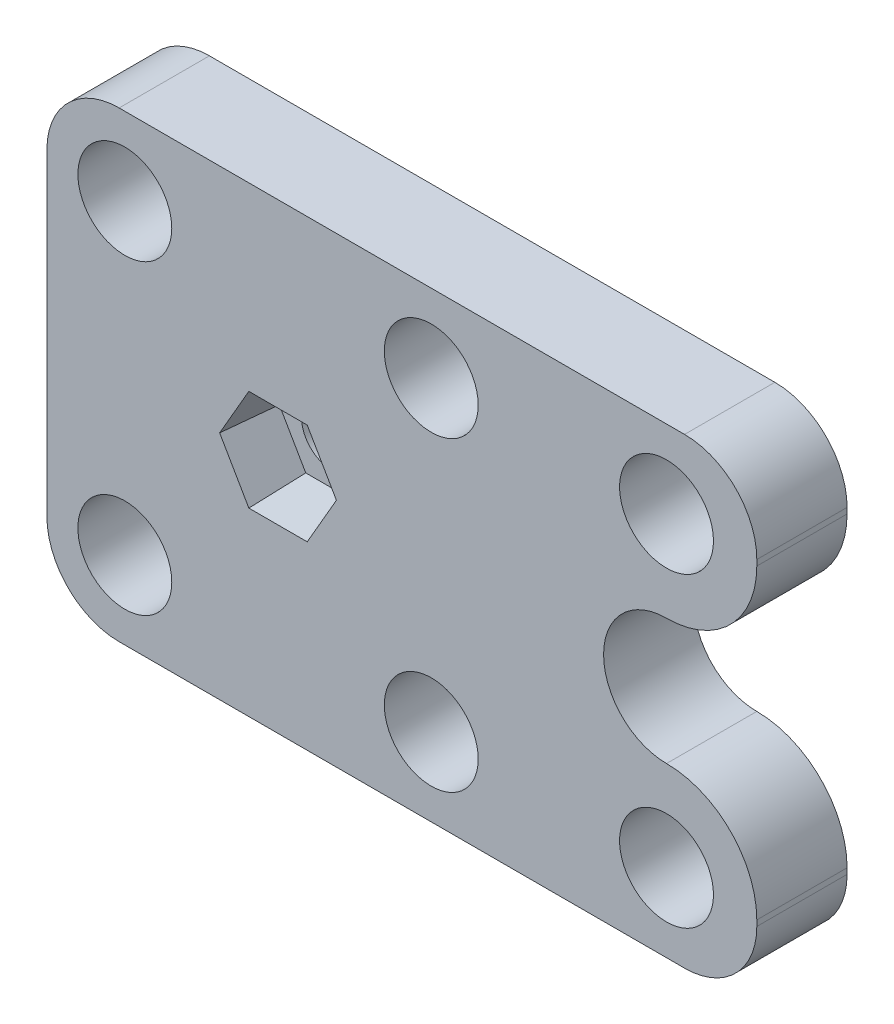
ISO-10303-21;
HEADER;
FILE_DESCRIPTION(('STEP AP214'),'2;1');
FILE_NAME('part.step','',(''),(''),'','','');
FILE_SCHEMA(('AUTOMOTIVE_DESIGN { 1 0 10303 214 1 1 1 1 }'));
ENDSEC;
DATA;
#1=APPLICATION_CONTEXT('core data for automotive mechanical design processes');
#2=APPLICATION_PROTOCOL_DEFINITION('international standard','automotive_design',2000,#1);
#3=PRODUCT_CONTEXT('',#1,'mechanical');
#4=PRODUCT('Part','Part','',(#3));
#5=PRODUCT_RELATED_PRODUCT_CATEGORY('part','',(#4));
#6=PRODUCT_DEFINITION_FORMATION('','',#4);
#7=PRODUCT_DEFINITION_CONTEXT('part definition',#1,'design');
#8=PRODUCT_DEFINITION('design','',#6,#7);
#9=PRODUCT_DEFINITION_SHAPE('','',#8);
#10=(LENGTH_UNIT() NAMED_UNIT(*) SI_UNIT(.MILLI.,.METRE.));
#11=(NAMED_UNIT(*) PLANE_ANGLE_UNIT() SI_UNIT($,.RADIAN.));
#12=(NAMED_UNIT(*) SI_UNIT($,.STERADIAN.) SOLID_ANGLE_UNIT());
#13=UNCERTAINTY_MEASURE_WITH_UNIT(LENGTH_MEASURE(1.E-05),#10,'distance_accuracy_value','');
#14=(GEOMETRIC_REPRESENTATION_CONTEXT(3) GLOBAL_UNCERTAINTY_ASSIGNED_CONTEXT((#13)) GLOBAL_UNIT_ASSIGNED_CONTEXT((#10,
#11,#12)) REPRESENTATION_CONTEXT('',''));
#15=CARTESIAN_POINT('',(0.,0.,0.));
#16=DIRECTION('',(0.,0.,1.));
#17=DIRECTION('',(1.,0.,0.));
#18=AXIS2_PLACEMENT_3D('',#15,#16,#17);
#19=CARTESIAN_POINT('',(0.,0.,5.));
#20=DIRECTION('',(0.,0.,-1.));
#21=DIRECTION('',(-1.,0.,0.));
#22=AXIS2_PLACEMENT_3D('',#19,#20,#21);
#23=CYLINDRICAL_SURFACE('',#22,1.7);
#24=CARTESIAN_POINT('',(0.,0.,0.));
#25=DIRECTION('',(0.,0.,1.));
#26=DIRECTION('',(1.,0.,0.));
#27=AXIS2_PLACEMENT_3D('',#24,#25,#26);
#28=CIRCLE('',#27,1.7);
#29=CARTESIAN_POINT('',(1.7,0.,0.));
#30=VERTEX_POINT('',#29);
#31=EDGE_CURVE('E255',#30,#30,#28,.T.);
#32=ORIENTED_EDGE('',*,*,#31,.F.);
#33=EDGE_LOOP('',(#32));
#34=FACE_BOUND('',#33,.T.);
#35=CARTESIAN_POINT('',(0.,0.,2.));
#36=DIRECTION('',(0.,0.,1.));
#37=DIRECTION('',(1.,0.,0.));
#38=AXIS2_PLACEMENT_3D('',#35,#36,#37);
#39=CIRCLE('',#38,1.7);
#40=CARTESIAN_POINT('',(1.7,0.,2.));
#41=VERTEX_POINT('',#40);
#42=EDGE_CURVE('E200',#41,#41,#39,.T.);
#43=ORIENTED_EDGE('',*,*,#42,.T.);
#44=EDGE_LOOP('',(#43));
#45=FACE_BOUND('',#44,.T.);
#46=ADVANCED_FACE('F33',(#34,#45),#23,.F.);
#47=CARTESIAN_POINT('',(21.5147186257615,8.48528137423833,5.));
#48=DIRECTION('',(0.,0.,1.));
#49=DIRECTION('',(1.,0.,0.));
#50=AXIS2_PLACEMENT_3D('',#47,#48,#49);
#51=PLANE('',#50);
#52=DIRECTION('',(0.5,0.866025403784439,0.));
#53=VECTOR('',#52,1.);
#54=CARTESIAN_POINT('',(1.61658075373095,-2.8,5.));
#55=LINE('',#54,#53);
#56=CARTESIAN_POINT('',(1.61658075373095,-2.8,5.));
#57=VERTEX_POINT('',#56);
#58=CARTESIAN_POINT('',(3.23316150746191,0.,5.));
#59=VERTEX_POINT('',#58);
#60=EDGE_CURVE('E180',#57,#59,#55,.T.);
#61=ORIENTED_EDGE('',*,*,#60,.F.);
#62=DIRECTION('',(1.,0.,0.));
#63=VECTOR('',#62,1.);
#64=CARTESIAN_POINT('',(-1.61658075373095,-2.8,5.));
#65=LINE('',#64,#63);
#66=CARTESIAN_POINT('',(-1.61658075373095,-2.8,5.));
#67=VERTEX_POINT('',#66);
#68=EDGE_CURVE('E194',#67,#57,#65,.T.);
#69=ORIENTED_EDGE('',*,*,#68,.F.);
#70=DIRECTION('',(0.5,-0.866025403784439,0.));
#71=VECTOR('',#70,1.);
#72=CARTESIAN_POINT('',(-3.23316150746191,0.,5.));
#73=LINE('',#72,#71);
#74=CARTESIAN_POINT('',(-3.23316150746191,0.,5.));
#75=VERTEX_POINT('',#74);
#76=EDGE_CURVE('E188',#75,#67,#73,.T.);
#77=ORIENTED_EDGE('',*,*,#76,.F.);
#78=DIRECTION('',(-0.5,-0.866025403784439,0.));
#79=VECTOR('',#78,1.);
#80=CARTESIAN_POINT('',(-1.61658075373095,2.8,5.));
#81=LINE('',#80,#79);
#82=CARTESIAN_POINT('',(-1.61658075373095,2.8,5.));
#83=VERTEX_POINT('',#82);
#84=EDGE_CURVE('E186',#83,#75,#81,.T.);
#85=ORIENTED_EDGE('',*,*,#84,.F.);
#86=DIRECTION('',(-1.,0.,0.));
#87=VECTOR('',#86,1.);
#88=CARTESIAN_POINT('',(1.61658075373095,2.8,5.));
#89=LINE('',#88,#87);
#90=CARTESIAN_POINT('',(1.61658075373095,2.8,5.));
#91=VERTEX_POINT('',#90);
#92=EDGE_CURVE('E164',#91,#83,#89,.T.);
#93=ORIENTED_EDGE('',*,*,#92,.F.);
#94=DIRECTION('',(-0.5,0.866025403784439,0.));
#95=VECTOR('',#94,1.);
#96=CARTESIAN_POINT('',(3.23316150746191,0.,5.));
#97=LINE('',#96,#95);
#98=EDGE_CURVE('E176',#59,#91,#97,.T.);
#99=ORIENTED_EDGE('',*,*,#98,.F.);
#100=EDGE_LOOP('',(#61,#69,#77,#85,#93,#99));
#101=FACE_BOUND('',#100,.T.);
#102=CARTESIAN_POINT('',(21.5147186257615,-8.48528137423881,5.));
#103=DIRECTION('',(0.,0.,1.));
#104=DIRECTION('',(1.,0.,0.));
#105=AXIS2_PLACEMENT_3D('',#102,#103,#104);
#106=CIRCLE('',#105,2.59999999999989);
#107=CARTESIAN_POINT('',(24.1147186257614,-8.48528137423881,5.));
#108=VERTEX_POINT('',#107);
#109=EDGE_CURVE('E228',#108,#108,#106,.T.);
#110=ORIENTED_EDGE('',*,*,#109,.F.);
#111=EDGE_LOOP('',(#110));
#112=FACE_BOUND('',#111,.T.);
#113=CARTESIAN_POINT('',(8.48528137423905,-8.48528137423809,5.));
#114=DIRECTION('',(0.,0.,1.));
#115=DIRECTION('',(1.,0.,0.));
#116=AXIS2_PLACEMENT_3D('',#113,#114,#115);
#117=CIRCLE('',#116,2.6);
#118=CARTESIAN_POINT('',(11.0852813742391,-8.48528137423809,5.));
#119=VERTEX_POINT('',#118);
#120=EDGE_CURVE('E240',#119,#119,#117,.T.);
#121=ORIENTED_EDGE('',*,*,#120,.F.);
#122=EDGE_LOOP('',(#121));
#123=FACE_BOUND('',#122,.T.);
#124=CARTESIAN_POINT('',(-8.48528137423857,8.48528137423857,5.));
#125=DIRECTION('',(0.,0.,1.));
#126=DIRECTION('',(1.,0.,0.));
#127=AXIS2_PLACEMENT_3D('',#124,#125,#126);
#128=CIRCLE('',#127,2.6);
#129=CARTESIAN_POINT('',(-5.88528137423857,8.48528137423857,5.));
#130=VERTEX_POINT('',#129);
#131=EDGE_CURVE('E252',#130,#130,#128,.T.);
#132=ORIENTED_EDGE('',*,*,#131,.F.);
#133=EDGE_LOOP('',(#132));
#134=FACE_BOUND('',#133,.T.);
#135=DIRECTION('',(1.,0.,0.));
#136=VECTOR('',#135,1.);
#137=CARTESIAN_POINT('',(-12.8,-12.8,5.));
#138=LINE('',#137,#136);
#139=CARTESIAN_POINT('',(-8.8,-12.8,5.));
#140=VERTEX_POINT('',#139);
#141=CARTESIAN_POINT('',(22.5147186257615,-12.8,5.));
#142=VERTEX_POINT('',#141);
#143=EDGE_CURVE('E267',#140,#142,#138,.T.);
#144=ORIENTED_EDGE('',*,*,#143,.T.);
#145=CARTESIAN_POINT('',(22.5147186257615,-8.8,5.));
#146=DIRECTION('',(0.,0.,1.));
#147=DIRECTION('',(1.,0.,0.));
#148=AXIS2_PLACEMENT_3D('',#145,#146,#147);
#149=CIRCLE('',#148,4.);
#150=CARTESIAN_POINT('',(26.5147186257615,-8.8,5.));
#151=VERTEX_POINT('',#150);
#152=EDGE_CURVE('E332',#142,#151,#149,.T.);
#153=ORIENTED_EDGE('',*,*,#152,.T.);
#154=DIRECTION('',(0.,1.,0.));
#155=VECTOR('',#154,1.);
#156=CARTESIAN_POINT('',(26.5147186257615,-12.8,5.));
#157=LINE('',#156,#155);
#158=CARTESIAN_POINT('',(26.5147186257615,-8.48528137423835,5.));
#159=VERTEX_POINT('',#158);
#160=EDGE_CURVE('E270',#151,#159,#157,.T.);
#161=ORIENTED_EDGE('',*,*,#160,.T.);
#162=CARTESIAN_POINT('',(21.5147186257615,-8.48528137423881,5.));
#163=DIRECTION('',(0.,0.,1.));
#164=DIRECTION('',(-1.,0.,0.));
#165=AXIS2_PLACEMENT_3D('',#162,#163,#164);
#166=CIRCLE('',#165,5.00000000000024);
#167=CARTESIAN_POINT('',(21.5147186257615,-3.48528137423857,5.));
#168=VERTEX_POINT('',#167);
#169=EDGE_CURVE('E272',#159,#168,#166,.T.);
#170=ORIENTED_EDGE('',*,*,#169,.T.);
#171=CARTESIAN_POINT('',(21.5147186257615,-2.37657116208823E-13,5.));
#172=DIRECTION('',(0.,0.,-1.));
#173=DIRECTION('',(-1.,0.,0.));
#174=AXIS2_PLACEMENT_3D('',#171,#172,#173);
#175=CIRCLE('',#174,3.48528137423835);
#176=CARTESIAN_POINT('',(21.5147186257615,3.48528137423811,5.));
#177=VERTEX_POINT('',#176);
#178=EDGE_CURVE('E274',#168,#177,#175,.T.);
#179=ORIENTED_EDGE('',*,*,#178,.T.);
#180=CARTESIAN_POINT('',(21.5147186257615,8.48528137423833,5.));
#181=DIRECTION('',(0.,0.,1.));
#182=DIRECTION('',(1.,0.,0.));
#183=AXIS2_PLACEMENT_3D('',#180,#181,#182);
#184=CIRCLE('',#183,5.);
#185=CARTESIAN_POINT('',(26.5147186257615,8.48528137423835,5.));
#186=VERTEX_POINT('',#185);
#187=EDGE_CURVE('E276',#177,#186,#184,.T.);
#188=ORIENTED_EDGE('',*,*,#187,.T.);
#189=DIRECTION('',(0.,1.,0.));
#190=VECTOR('',#189,1.);
#191=CARTESIAN_POINT('',(26.5147186257615,12.8,5.));
#192=LINE('',#191,#190);
#193=CARTESIAN_POINT('',(26.5147186257615,8.8,5.));
#194=VERTEX_POINT('',#193);
#195=EDGE_CURVE('E278',#186,#194,#192,.T.);
#196=ORIENTED_EDGE('',*,*,#195,.T.);
#197=CARTESIAN_POINT('',(22.5147186257615,8.8,5.));
#198=DIRECTION('',(0.,0.,1.));
#199=DIRECTION('',(1.,0.,0.));
#200=AXIS2_PLACEMENT_3D('',#197,#198,#199);
#201=CIRCLE('',#200,4.);
#202=CARTESIAN_POINT('',(22.5147186257615,12.8,5.));
#203=VERTEX_POINT('',#202);
#204=EDGE_CURVE('E330',#194,#203,#201,.T.);
#205=ORIENTED_EDGE('',*,*,#204,.T.);
#206=DIRECTION('',(-1.,0.,0.));
#207=VECTOR('',#206,1.);
#208=CARTESIAN_POINT('',(12.8,12.8,5.));
#209=LINE('',#208,#207);
#210=CARTESIAN_POINT('',(-8.79999999999999,12.8,5.));
#211=VERTEX_POINT('',#210);
#212=EDGE_CURVE('E261',#203,#211,#209,.T.);
#213=ORIENTED_EDGE('',*,*,#212,.T.);
#214=CARTESIAN_POINT('',(-8.8,8.8,5.));
#215=DIRECTION('',(0.,0.,1.));
#216=DIRECTION('',(1.,0.,0.));
#217=AXIS2_PLACEMENT_3D('',#214,#215,#216);
#218=CIRCLE('',#217,4.);
#219=CARTESIAN_POINT('',(-12.8,8.8,5.));
#220=VERTEX_POINT('',#219);
#221=EDGE_CURVE('E326',#211,#220,#218,.T.);
#222=ORIENTED_EDGE('',*,*,#221,.T.);
#223=DIRECTION('',(0.,-1.,0.));
#224=VECTOR('',#223,1.);
#225=CARTESIAN_POINT('',(-12.8,-12.8,5.));
#226=LINE('',#225,#224);
#227=CARTESIAN_POINT('',(-12.8,-8.8,5.));
#228=VERTEX_POINT('',#227);
#229=EDGE_CURVE('E264',#220,#228,#226,.T.);
#230=ORIENTED_EDGE('',*,*,#229,.T.);
#231=CARTESIAN_POINT('',(-8.8,-8.8,5.));
#232=DIRECTION('',(0.,0.,1.));
#233=DIRECTION('',(1.,0.,0.));
#234=AXIS2_PLACEMENT_3D('',#231,#232,#233);
#235=CIRCLE('',#234,4.);
#236=EDGE_CURVE('E328',#228,#140,#235,.T.);
#237=ORIENTED_EDGE('',*,*,#236,.T.);
#238=EDGE_LOOP('',(#144,#153,#161,#170,#179,#188,#196,#205,#213,#222,#230,#237));
#239=FACE_BOUND('',#238,.T.);
#240=CARTESIAN_POINT('',(8.48528137423857,8.48528137423905,5.));
#241=DIRECTION('',(0.,0.,1.));
#242=DIRECTION('',(1.,0.,0.));
#243=AXIS2_PLACEMENT_3D('',#240,#241,#242);
#244=CIRCLE('',#243,2.6);
#245=CARTESIAN_POINT('',(11.0852813742386,8.48528137423905,5.));
#246=VERTEX_POINT('',#245);
#247=EDGE_CURVE('E246',#246,#246,#244,.T.);
#248=ORIENTED_EDGE('',*,*,#247,.F.);
#249=EDGE_LOOP('',(#248));
#250=FACE_BOUND('',#249,.T.);
#251=CARTESIAN_POINT('',(-8.48528137423809,-8.48528137423857,5.));
#252=DIRECTION('',(0.,0.,1.));
#253=DIRECTION('',(1.,0.,0.));
#254=AXIS2_PLACEMENT_3D('',#251,#252,#253);
#255=CIRCLE('',#254,2.6);
#256=CARTESIAN_POINT('',(-5.88528137423809,-8.48528137423857,5.));
#257=VERTEX_POINT('',#256);
#258=EDGE_CURVE('E234',#257,#257,#255,.T.);
#259=ORIENTED_EDGE('',*,*,#258,.F.);
#260=EDGE_LOOP('',(#259));
#261=FACE_BOUND('',#260,.T.);
#262=CARTESIAN_POINT('',(21.5147186257615,8.48528137423833,5.));
#263=DIRECTION('',(0.,0.,1.));
#264=DIRECTION('',(1.,0.,0.));
#265=AXIS2_PLACEMENT_3D('',#262,#263,#264);
#266=CIRCLE('',#265,2.60000000000008);
#267=CARTESIAN_POINT('',(24.1147186257616,8.48528137423833,5.));
#268=VERTEX_POINT('',#267);
#269=EDGE_CURVE('E221',#268,#268,#266,.T.);
#270=ORIENTED_EDGE('',*,*,#269,.F.);
#271=EDGE_LOOP('',(#270));
#272=FACE_BOUND('',#271,.T.);
#273=ADVANCED_FACE('F182',(#101,#112,#123,#134,#239,#250,#261,#272),#51,.T.);
#274=CARTESIAN_POINT('',(21.5147186257615,8.48528137423833,0.));
#275=DIRECTION('',(0.,0.,1.));
#276=DIRECTION('',(1.,0.,0.));
#277=AXIS2_PLACEMENT_3D('',#274,#275,#276);
#278=PLANE('',#277);
#279=CARTESIAN_POINT('',(21.5147186257615,-8.48528137423881,0.));
#280=DIRECTION('',(0.,0.,1.));
#281=DIRECTION('',(1.,0.,0.));
#282=AXIS2_PLACEMENT_3D('',#279,#280,#281);
#283=CIRCLE('',#282,2.59999999999989);
#284=CARTESIAN_POINT('',(24.1147186257614,-8.48528137423881,0.));
#285=VERTEX_POINT('',#284);
#286=EDGE_CURVE('E224',#285,#285,#283,.T.);
#287=ORIENTED_EDGE('',*,*,#286,.T.);
#288=EDGE_LOOP('',(#287));
#289=FACE_BOUND('',#288,.T.);
#290=CARTESIAN_POINT('',(8.48528137423905,-8.48528137423809,0.));
#291=DIRECTION('',(0.,0.,1.));
#292=DIRECTION('',(1.,0.,0.));
#293=AXIS2_PLACEMENT_3D('',#290,#291,#292);
#294=CIRCLE('',#293,2.6);
#295=CARTESIAN_POINT('',(11.0852813742391,-8.48528137423809,0.));
#296=VERTEX_POINT('',#295);
#297=EDGE_CURVE('E237',#296,#296,#294,.T.);
#298=ORIENTED_EDGE('',*,*,#297,.T.);
#299=EDGE_LOOP('',(#298));
#300=FACE_BOUND('',#299,.T.);
#301=CARTESIAN_POINT('',(-8.48528137423857,8.48528137423857,0.));
#302=DIRECTION('',(0.,0.,1.));
#303=DIRECTION('',(1.,0.,0.));
#304=AXIS2_PLACEMENT_3D('',#301,#302,#303);
#305=CIRCLE('',#304,2.6);
#306=CARTESIAN_POINT('',(-5.88528137423857,8.48528137423857,0.));
#307=VERTEX_POINT('',#306);
#308=EDGE_CURVE('E249',#307,#307,#305,.T.);
#309=ORIENTED_EDGE('',*,*,#308,.T.);
#310=EDGE_LOOP('',(#309));
#311=FACE_BOUND('',#310,.T.);
#312=DIRECTION('',(0.,1.,0.));
#313=VECTOR('',#312,1.);
#314=CARTESIAN_POINT('',(26.5147186257615,-12.8,0.));
#315=LINE('',#314,#313);
#316=CARTESIAN_POINT('',(26.5147186257615,-8.8,0.));
#317=VERTEX_POINT('',#316);
#318=CARTESIAN_POINT('',(26.5147186257615,-8.48528137423835,0.));
#319=VERTEX_POINT('',#318);
#320=EDGE_CURVE('E288',#317,#319,#315,.T.);
#321=ORIENTED_EDGE('',*,*,#320,.F.);
#322=CARTESIAN_POINT('',(22.5147186257615,-8.8,0.));
#323=DIRECTION('',(0.,0.,1.));
#324=DIRECTION('',(1.,0.,0.));
#325=AXIS2_PLACEMENT_3D('',#322,#323,#324);
#326=CIRCLE('',#325,4.);
#327=CARTESIAN_POINT('',(22.5147186257615,-12.8,0.));
#328=VERTEX_POINT('',#327);
#329=EDGE_CURVE('E319',#317,#328,#326,.F.);
#330=ORIENTED_EDGE('',*,*,#329,.T.);
#331=DIRECTION('',(1.,0.,0.));
#332=VECTOR('',#331,1.);
#333=CARTESIAN_POINT('',(12.8,-12.8,0.));
#334=LINE('',#333,#332);
#335=CARTESIAN_POINT('',(-8.79999999999999,-12.8,0.));
#336=VERTEX_POINT('',#335);
#337=EDGE_CURVE('E285',#336,#328,#334,.T.);
#338=ORIENTED_EDGE('',*,*,#337,.F.);
#339=CARTESIAN_POINT('',(-8.8,-8.8,0.));
#340=DIRECTION('',(0.,0.,1.));
#341=DIRECTION('',(1.,0.,0.));
#342=AXIS2_PLACEMENT_3D('',#339,#340,#341);
#343=CIRCLE('',#342,4.);
#344=CARTESIAN_POINT('',(-12.8,-8.8,0.));
#345=VERTEX_POINT('',#344);
#346=EDGE_CURVE('E315',#336,#345,#343,.F.);
#347=ORIENTED_EDGE('',*,*,#346,.T.);
#348=DIRECTION('',(0.,-1.,0.));
#349=VECTOR('',#348,1.);
#350=CARTESIAN_POINT('',(-12.8,-12.8,0.));
#351=LINE('',#350,#349);
#352=CARTESIAN_POINT('',(-12.8,8.8,0.));
#353=VERTEX_POINT('',#352);
#354=EDGE_CURVE('E283',#353,#345,#351,.T.);
#355=ORIENTED_EDGE('',*,*,#354,.F.);
#356=CARTESIAN_POINT('',(-8.8,8.8,0.));
#357=DIRECTION('',(0.,0.,1.));
#358=DIRECTION('',(1.,0.,0.));
#359=AXIS2_PLACEMENT_3D('',#356,#357,#358);
#360=CIRCLE('',#359,4.);
#361=CARTESIAN_POINT('',(-8.8,12.8,0.));
#362=VERTEX_POINT('',#361);
#363=EDGE_CURVE('E313',#353,#362,#360,.F.);
#364=ORIENTED_EDGE('',*,*,#363,.T.);
#365=DIRECTION('',(-1.,0.,0.));
#366=VECTOR('',#365,1.);
#367=CARTESIAN_POINT('',(-12.8,12.8,0.));
#368=LINE('',#367,#366);
#369=CARTESIAN_POINT('',(22.5147186257615,12.8,0.));
#370=VERTEX_POINT('',#369);
#371=EDGE_CURVE('E260',#370,#362,#368,.T.);
#372=ORIENTED_EDGE('',*,*,#371,.F.);
#373=CARTESIAN_POINT('',(22.5147186257615,8.8,0.));
#374=DIRECTION('',(0.,0.,1.));
#375=DIRECTION('',(1.,0.,0.));
#376=AXIS2_PLACEMENT_3D('',#373,#374,#375);
#377=CIRCLE('',#376,4.);
#378=CARTESIAN_POINT('',(26.5147186257615,8.8,0.));
#379=VERTEX_POINT('',#378);
#380=EDGE_CURVE('E317',#370,#379,#377,.F.);
#381=ORIENTED_EDGE('',*,*,#380,.T.);
#382=DIRECTION('',(0.,1.,0.));
#383=VECTOR('',#382,1.);
#384=CARTESIAN_POINT('',(26.5147186257615,12.8,0.));
#385=LINE('',#384,#383);
#386=CARTESIAN_POINT('',(26.5147186257615,8.48528137423835,0.));
#387=VERTEX_POINT('',#386);
#388=EDGE_CURVE('E265',#387,#379,#385,.T.);
#389=ORIENTED_EDGE('',*,*,#388,.F.);
#390=CARTESIAN_POINT('',(21.5147186257615,8.48528137423833,0.));
#391=DIRECTION('',(0.,0.,1.));
#392=DIRECTION('',(1.,0.,0.));
#393=AXIS2_PLACEMENT_3D('',#390,#391,#392);
#394=CIRCLE('',#393,5.);
#395=CARTESIAN_POINT('',(21.5147186257615,3.48528137423811,0.));
#396=VERTEX_POINT('',#395);
#397=EDGE_CURVE('E294',#396,#387,#394,.T.);
#398=ORIENTED_EDGE('',*,*,#397,.F.);
#399=CARTESIAN_POINT('',(21.5147186257615,-2.37657116208823E-13,0.));
#400=DIRECTION('',(0.,0.,-1.));
#401=DIRECTION('',(-1.,0.,0.));
#402=AXIS2_PLACEMENT_3D('',#399,#400,#401);
#403=CIRCLE('',#402,3.48528137423835);
#404=CARTESIAN_POINT('',(21.5147186257615,-3.48528137423857,0.));
#405=VERTEX_POINT('',#404);
#406=EDGE_CURVE('E292',#405,#396,#403,.T.);
#407=ORIENTED_EDGE('',*,*,#406,.F.);
#408=CARTESIAN_POINT('',(21.5147186257615,-8.48528137423881,0.));
#409=DIRECTION('',(0.,0.,1.));
#410=DIRECTION('',(-1.,0.,0.));
#411=AXIS2_PLACEMENT_3D('',#408,#409,#410);
#412=CIRCLE('',#411,5.00000000000024);
#413=EDGE_CURVE('E290',#319,#405,#412,.T.);
#414=ORIENTED_EDGE('',*,*,#413,.F.);
#415=EDGE_LOOP('',(#321,#330,#338,#347,#355,#364,#372,#381,#389,#398,#407,#414));
#416=FACE_BOUND('',#415,.T.);
#417=ORIENTED_EDGE('',*,*,#31,.T.);
#418=EDGE_LOOP('',(#417));
#419=FACE_BOUND('',#418,.T.);
#420=CARTESIAN_POINT('',(8.48528137423857,8.48528137423905,0.));
#421=DIRECTION('',(0.,0.,1.));
#422=DIRECTION('',(1.,0.,0.));
#423=AXIS2_PLACEMENT_3D('',#420,#421,#422);
#424=CIRCLE('',#423,2.6);
#425=CARTESIAN_POINT('',(11.0852813742386,8.48528137423905,0.));
#426=VERTEX_POINT('',#425);
#427=EDGE_CURVE('E243',#426,#426,#424,.T.);
#428=ORIENTED_EDGE('',*,*,#427,.T.);
#429=EDGE_LOOP('',(#428));
#430=FACE_BOUND('',#429,.T.);
#431=CARTESIAN_POINT('',(-8.48528137423809,-8.48528137423857,0.));
#432=DIRECTION('',(0.,0.,1.));
#433=DIRECTION('',(1.,0.,0.));
#434=AXIS2_PLACEMENT_3D('',#431,#432,#433);
#435=CIRCLE('',#434,2.6);
#436=CARTESIAN_POINT('',(-5.88528137423809,-8.48528137423857,0.));
#437=VERTEX_POINT('',#436);
#438=EDGE_CURVE('E231',#437,#437,#435,.T.);
#439=ORIENTED_EDGE('',*,*,#438,.T.);
#440=EDGE_LOOP('',(#439));
#441=FACE_BOUND('',#440,.T.);
#442=CARTESIAN_POINT('',(21.5147186257615,8.48528137423833,0.));
#443=DIRECTION('',(0.,0.,1.));
#444=DIRECTION('',(1.,0.,0.));
#445=AXIS2_PLACEMENT_3D('',#442,#443,#444);
#446=CIRCLE('',#445,2.60000000000008);
#447=CARTESIAN_POINT('',(24.1147186257616,8.48528137423833,0.));
#448=VERTEX_POINT('',#447);
#449=EDGE_CURVE('E225',#448,#448,#446,.T.);
#450=ORIENTED_EDGE('',*,*,#449,.T.);
#451=EDGE_LOOP('',(#450));
#452=FACE_BOUND('',#451,.T.);
#453=ADVANCED_FACE('F347',(#289,#300,#311,#416,#419,#430,#441,#452),#278,.F.);
#454=CARTESIAN_POINT('',(-12.8,12.8,5.));
#455=DIRECTION('',(0.,-1.,0.));
#456=DIRECTION('',(0.,0.,-1.));
#457=AXIS2_PLACEMENT_3D('',#454,#455,#456);
#458=PLANE('',#457);
#459=ORIENTED_EDGE('',*,*,#212,.F.);
#460=DIRECTION('',(0.,0.,-1.));
#461=VECTOR('',#460,1.);
#462=CARTESIAN_POINT('',(22.5147186257615,12.8,5.));
#463=LINE('',#462,#461);
#464=EDGE_CURVE('E336',#203,#370,#463,.T.);
#465=ORIENTED_EDGE('',*,*,#464,.T.);
#466=ORIENTED_EDGE('',*,*,#371,.T.);
#467=DIRECTION('',(0.,0.,-1.));
#468=VECTOR('',#467,1.);
#469=CARTESIAN_POINT('',(-8.8,12.8,5.));
#470=LINE('',#469,#468);
#471=EDGE_CURVE('E334',#362,#211,#470,.F.);
#472=ORIENTED_EDGE('',*,*,#471,.T.);
#473=EDGE_LOOP('',(#459,#465,#466,#472));
#474=FACE_BOUND('',#473,.T.);
#475=ADVANCED_FACE('F410',(#474),#458,.F.);
#476=CARTESIAN_POINT('',(-12.8,-12.8,5.));
#477=DIRECTION('',(1.,0.,0.));
#478=DIRECTION('',(0.,0.,-1.));
#479=AXIS2_PLACEMENT_3D('',#476,#477,#478);
#480=PLANE('',#479);
#481=ORIENTED_EDGE('',*,*,#354,.T.);
#482=DIRECTION('',(0.,0.,-1.));
#483=VECTOR('',#482,1.);
#484=CARTESIAN_POINT('',(-12.8,-8.8,5.));
#485=LINE('',#484,#483);
#486=EDGE_CURVE('E11',#345,#228,#485,.F.);
#487=ORIENTED_EDGE('',*,*,#486,.T.);
#488=ORIENTED_EDGE('',*,*,#229,.F.);
#489=DIRECTION('',(0.,0.,-1.));
#490=VECTOR('',#489,1.);
#491=CARTESIAN_POINT('',(-12.8,8.8,5.));
#492=LINE('',#491,#490);
#493=EDGE_CURVE('E41',#220,#353,#492,.T.);
#494=ORIENTED_EDGE('',*,*,#493,.T.);
#495=EDGE_LOOP('',(#481,#487,#488,#494));
#496=FACE_BOUND('',#495,.T.);
#497=ADVANCED_FACE('F342',(#496),#480,.F.);
#498=CARTESIAN_POINT('',(12.8,-12.8,5.));
#499=DIRECTION('',(0.,1.,0.));
#500=DIRECTION('',(0.,0.,1.));
#501=AXIS2_PLACEMENT_3D('',#498,#499,#500);
#502=PLANE('',#501);
#503=ORIENTED_EDGE('',*,*,#337,.T.);
#504=DIRECTION('',(0.,0.,-1.));
#505=VECTOR('',#504,1.);
#506=CARTESIAN_POINT('',(22.5147186257615,-12.8,5.));
#507=LINE('',#506,#505);
#508=EDGE_CURVE('E324',#328,#142,#507,.F.);
#509=ORIENTED_EDGE('',*,*,#508,.T.);
#510=ORIENTED_EDGE('',*,*,#143,.F.);
#511=DIRECTION('',(0.,0.,-1.));
#512=VECTOR('',#511,1.);
#513=CARTESIAN_POINT('',(-8.8,-12.8,5.));
#514=LINE('',#513,#512);
#515=EDGE_CURVE('E321',#140,#336,#514,.T.);
#516=ORIENTED_EDGE('',*,*,#515,.T.);
#517=EDGE_LOOP('',(#503,#509,#510,#516));
#518=FACE_BOUND('',#517,.T.);
#519=ADVANCED_FACE('F357',(#518),#502,.F.);
#520=CARTESIAN_POINT('',(26.5147186257615,-12.8,5.));
#521=DIRECTION('',(-1.,0.,0.));
#522=DIRECTION('',(0.,0.,1.));
#523=AXIS2_PLACEMENT_3D('',#520,#521,#522);
#524=PLANE('',#523);
#525=ORIENTED_EDGE('',*,*,#160,.F.);
#526=DIRECTION('',(0.,0.,-1.));
#527=VECTOR('',#526,1.);
#528=CARTESIAN_POINT('',(26.5147186257615,-8.8,5.));
#529=LINE('',#528,#527);
#530=EDGE_CURVE('E308',#151,#317,#529,.T.);
#531=ORIENTED_EDGE('',*,*,#530,.T.);
#532=ORIENTED_EDGE('',*,*,#320,.T.);
#533=DIRECTION('',(0.,0.,-1.));
#534=VECTOR('',#533,1.);
#535=CARTESIAN_POINT('',(26.5147186257615,-8.48528137423835,5.));
#536=LINE('',#535,#534);
#537=EDGE_CURVE('E305',#159,#319,#536,.T.);
#538=ORIENTED_EDGE('',*,*,#537,.F.);
#539=EDGE_LOOP('',(#525,#531,#532,#538));
#540=FACE_BOUND('',#539,.T.);
#541=ADVANCED_FACE('F367',(#540),#524,.F.);
#542=CARTESIAN_POINT('',(21.5147186257615,-8.48528137423881,5.));
#543=DIRECTION('',(0.,0.,-1.));
#544=DIRECTION('',(-1.,0.,0.));
#545=AXIS2_PLACEMENT_3D('',#542,#543,#544);
#546=CYLINDRICAL_SURFACE('',#545,5.00000000000024);
#547=ORIENTED_EDGE('',*,*,#413,.T.);
#548=DIRECTION('',(0.,0.,-1.));
#549=VECTOR('',#548,1.);
#550=CARTESIAN_POINT('',(21.5147186257615,-3.48528137423857,5.));
#551=LINE('',#550,#549);
#552=EDGE_CURVE('E302',#168,#405,#551,.T.);
#553=ORIENTED_EDGE('',*,*,#552,.F.);
#554=ORIENTED_EDGE('',*,*,#169,.F.);
#555=ORIENTED_EDGE('',*,*,#537,.T.);
#556=EDGE_LOOP('',(#547,#553,#554,#555));
#557=FACE_BOUND('',#556,.T.);
#558=ADVANCED_FACE('F374',(#557),#546,.T.);
#559=CARTESIAN_POINT('',(21.5147186257615,-2.37657116208823E-13,5.));
#560=DIRECTION('',(0.,0.,-1.));
#561=DIRECTION('',(-1.,0.,0.));
#562=AXIS2_PLACEMENT_3D('',#559,#560,#561);
#563=CYLINDRICAL_SURFACE('',#562,3.48528137423835);
#564=ORIENTED_EDGE('',*,*,#406,.T.);
#565=DIRECTION('',(0.,0.,-1.));
#566=VECTOR('',#565,1.);
#567=CARTESIAN_POINT('',(21.5147186257615,3.48528137423811,5.));
#568=LINE('',#567,#566);
#569=EDGE_CURVE('E299',#177,#396,#568,.T.);
#570=ORIENTED_EDGE('',*,*,#569,.F.);
#571=ORIENTED_EDGE('',*,*,#178,.F.);
#572=ORIENTED_EDGE('',*,*,#552,.T.);
#573=EDGE_LOOP('',(#564,#570,#571,#572));
#574=FACE_BOUND('',#573,.T.);
#575=ADVANCED_FACE('F378',(#574),#563,.F.);
#576=CARTESIAN_POINT('',(21.5147186257615,8.48528137423833,5.));
#577=DIRECTION('',(0.,0.,-1.));
#578=DIRECTION('',(-1.,0.,0.));
#579=AXIS2_PLACEMENT_3D('',#576,#577,#578);
#580=CYLINDRICAL_SURFACE('',#579,5.);
#581=ORIENTED_EDGE('',*,*,#397,.T.);
#582=DIRECTION('',(0.,0.,-1.));
#583=VECTOR('',#582,1.);
#584=CARTESIAN_POINT('',(26.5147186257615,8.48528137423835,5.));
#585=LINE('',#584,#583);
#586=EDGE_CURVE('E280',#186,#387,#585,.T.);
#587=ORIENTED_EDGE('',*,*,#586,.F.);
#588=ORIENTED_EDGE('',*,*,#187,.F.);
#589=ORIENTED_EDGE('',*,*,#569,.T.);
#590=EDGE_LOOP('',(#581,#587,#588,#589));
#591=FACE_BOUND('',#590,.T.);
#592=ADVANCED_FACE('F384',(#591),#580,.T.);
#593=CARTESIAN_POINT('',(26.5147186257615,12.8,5.));
#594=DIRECTION('',(-1.,0.,0.));
#595=DIRECTION('',(0.,0.,1.));
#596=AXIS2_PLACEMENT_3D('',#593,#594,#595);
#597=PLANE('',#596);
#598=ORIENTED_EDGE('',*,*,#388,.T.);
#599=DIRECTION('',(0.,0.,-1.));
#600=VECTOR('',#599,1.);
#601=CARTESIAN_POINT('',(26.5147186257615,8.8,5.));
#602=LINE('',#601,#600);
#603=EDGE_CURVE('E48',#379,#194,#602,.F.);
#604=ORIENTED_EDGE('',*,*,#603,.T.);
#605=ORIENTED_EDGE('',*,*,#195,.F.);
#606=ORIENTED_EDGE('',*,*,#586,.T.);
#607=EDGE_LOOP('',(#598,#604,#605,#606));
#608=FACE_BOUND('',#607,.T.);
#609=ADVANCED_FACE('F386',(#608),#597,.F.);
#610=CARTESIAN_POINT('',(-8.48528137423857,8.48528137423857,5.));
#611=DIRECTION('',(0.,0.,-1.));
#612=DIRECTION('',(-1.,0.,0.));
#613=AXIS2_PLACEMENT_3D('',#610,#611,#612);
#614=CYLINDRICAL_SURFACE('',#613,2.6);
#615=ORIENTED_EDGE('',*,*,#131,.T.);
#616=EDGE_LOOP('',(#615));
#617=FACE_BOUND('',#616,.T.);
#618=ORIENTED_EDGE('',*,*,#308,.F.);
#619=EDGE_LOOP('',(#618));
#620=FACE_BOUND('',#619,.T.);
#621=ADVANCED_FACE('F388',(#617,#620),#614,.F.);
#622=CARTESIAN_POINT('',(8.48528137423857,8.48528137423905,5.));
#623=DIRECTION('',(0.,0.,-1.));
#624=DIRECTION('',(-1.,0.,0.));
#625=AXIS2_PLACEMENT_3D('',#622,#623,#624);
#626=CYLINDRICAL_SURFACE('',#625,2.6);
#627=ORIENTED_EDGE('',*,*,#247,.T.);
#628=EDGE_LOOP('',(#627));
#629=FACE_BOUND('',#628,.T.);
#630=ORIENTED_EDGE('',*,*,#427,.F.);
#631=EDGE_LOOP('',(#630));
#632=FACE_BOUND('',#631,.T.);
#633=ADVANCED_FACE('F394',(#629,#632),#626,.F.);
#634=CARTESIAN_POINT('',(8.48528137423905,-8.48528137423809,5.));
#635=DIRECTION('',(0.,0.,-1.));
#636=DIRECTION('',(-1.,0.,0.));
#637=AXIS2_PLACEMENT_3D('',#634,#635,#636);
#638=CYLINDRICAL_SURFACE('',#637,2.6);
#639=ORIENTED_EDGE('',*,*,#120,.T.);
#640=EDGE_LOOP('',(#639));
#641=FACE_BOUND('',#640,.T.);
#642=ORIENTED_EDGE('',*,*,#297,.F.);
#643=EDGE_LOOP('',(#642));
#644=FACE_BOUND('',#643,.T.);
#645=ADVANCED_FACE('F424',(#641,#644),#638,.F.);
#646=CARTESIAN_POINT('',(-8.48528137423809,-8.48528137423857,5.));
#647=DIRECTION('',(0.,0.,-1.));
#648=DIRECTION('',(-1.,0.,0.));
#649=AXIS2_PLACEMENT_3D('',#646,#647,#648);
#650=CYLINDRICAL_SURFACE('',#649,2.6);
#651=ORIENTED_EDGE('',*,*,#258,.T.);
#652=EDGE_LOOP('',(#651));
#653=FACE_BOUND('',#652,.T.);
#654=ORIENTED_EDGE('',*,*,#438,.F.);
#655=EDGE_LOOP('',(#654));
#656=FACE_BOUND('',#655,.T.);
#657=ADVANCED_FACE('F426',(#653,#656),#650,.F.);
#658=CARTESIAN_POINT('',(21.5147186257615,-8.48528137423881,5.));
#659=DIRECTION('',(0.,0.,-1.));
#660=DIRECTION('',(-1.,0.,0.));
#661=AXIS2_PLACEMENT_3D('',#658,#659,#660);
#662=CYLINDRICAL_SURFACE('',#661,2.59999999999989);
#663=ORIENTED_EDGE('',*,*,#109,.T.);
#664=EDGE_LOOP('',(#663));
#665=FACE_BOUND('',#664,.T.);
#666=ORIENTED_EDGE('',*,*,#286,.F.);
#667=EDGE_LOOP('',(#666));
#668=FACE_BOUND('',#667,.T.);
#669=ADVANCED_FACE('F433',(#665,#668),#662,.F.);
#670=CARTESIAN_POINT('',(21.5147186257615,8.48528137423833,5.));
#671=DIRECTION('',(0.,0.,-1.));
#672=DIRECTION('',(-1.,0.,0.));
#673=AXIS2_PLACEMENT_3D('',#670,#671,#672);
#674=CYLINDRICAL_SURFACE('',#673,2.60000000000008);
#675=ORIENTED_EDGE('',*,*,#269,.T.);
#676=EDGE_LOOP('',(#675));
#677=FACE_BOUND('',#676,.T.);
#678=ORIENTED_EDGE('',*,*,#449,.F.);
#679=EDGE_LOOP('',(#678));
#680=FACE_BOUND('',#679,.T.);
#681=ADVANCED_FACE('F440',(#677,#680),#674,.F.);
#682=CARTESIAN_POINT('',(1.61658075373095,-2.8,5.));
#683=DIRECTION('',(0.862729915662821,-0.498097349045873,-0.0871557427476584));
#684=DIRECTION('',(0.5,0.866025403784439,0.));
#685=AXIS2_PLACEMENT_3D('',#682,#683,#684);
#686=PLANE('',#685);
#687=ORIENTED_EDGE('',*,*,#60,.T.);
#688=DIRECTION('',(0.100511613750393,0.,0.994935885120892));
#689=VECTOR('',#688,1.);
#690=CARTESIAN_POINT('',(3.21682986379835,0.,4.83833770310138));
#691=LINE('',#690,#689);
#692=CARTESIAN_POINT('',(2.93009188683551,0.,2.));
#693=VERTEX_POINT('',#692);
#694=EDGE_CURVE('E172',#693,#59,#691,.T.);
#695=ORIENTED_EDGE('',*,*,#694,.F.);
#696=DIRECTION('',(0.5,0.866025403784439,0.));
#697=VECTOR('',#696,1.);
#698=CARTESIAN_POINT('',(2.19756891512663,-1.26876700471111,2.));
#699=LINE('',#698,#697);
#700=CARTESIAN_POINT('',(1.46504594341775,-2.53753400942223,2.));
#701=VERTEX_POINT('',#700);
#702=EDGE_CURVE('E197',#701,#693,#699,.T.);
#703=ORIENTED_EDGE('',*,*,#702,.F.);
#704=DIRECTION('',(0.0502558068751963,-0.0870456108832093,0.994935885120891));
#705=VECTOR('',#704,1.);
#706=CARTESIAN_POINT('',(1.60841493189918,-2.78585638170181,4.83833770310138));
#707=LINE('',#706,#705);
#708=EDGE_CURVE('E198',#701,#57,#707,.T.);
#709=ORIENTED_EDGE('',*,*,#708,.T.);
#710=EDGE_LOOP('',(#687,#695,#703,#709));
#711=FACE_BOUND('',#710,.T.);
#712=ADVANCED_FACE('F444',(#711),#686,.F.);
#713=CARTESIAN_POINT('',(-1.61658075373095,-2.8,5.));
#714=DIRECTION('',(0.,-0.996194698091746,-0.0871557427476584));
#715=DIRECTION('',(0.,0.0871557427476584,-0.996194698091746));
#716=AXIS2_PLACEMENT_3D('',#713,#714,#715);
#717=PLANE('',#716);
#718=ORIENTED_EDGE('',*,*,#68,.T.);
#719=ORIENTED_EDGE('',*,*,#708,.F.);
#720=DIRECTION('',(1.,0.,0.));
#721=VECTOR('',#720,1.);
#722=CARTESIAN_POINT('',(0.,-2.53753400942223,2.));
#723=LINE('',#722,#721);
#724=CARTESIAN_POINT('',(-1.46504594341775,-2.53753400942223,2.));
#725=VERTEX_POINT('',#724);
#726=EDGE_CURVE('E202',#725,#701,#723,.T.);
#727=ORIENTED_EDGE('',*,*,#726,.F.);
#728=DIRECTION('',(-0.0502558068751962,-0.0870456108832093,0.994935885120892));
#729=VECTOR('',#728,1.);
#730=CARTESIAN_POINT('',(-1.60841493189918,-2.78585638170181,4.83833770310138));
#731=LINE('',#730,#729);
#732=EDGE_CURVE('E201',#725,#67,#731,.T.);
#733=ORIENTED_EDGE('',*,*,#732,.T.);
#734=EDGE_LOOP('',(#718,#719,#727,#733));
#735=FACE_BOUND('',#734,.T.);
#736=ADVANCED_FACE('F446',(#735),#717,.F.);
#737=CARTESIAN_POINT('',(-3.23316150746191,0.,5.));
#738=DIRECTION('',(-0.862729915662821,-0.498097349045873,-0.0871557427476584));
#739=DIRECTION('',(0.5,-0.866025403784439,0.));
#740=AXIS2_PLACEMENT_3D('',#737,#738,#739);
#741=PLANE('',#740);
#742=ORIENTED_EDGE('',*,*,#76,.T.);
#743=ORIENTED_EDGE('',*,*,#732,.F.);
#744=DIRECTION('',(0.5,-0.866025403784439,0.));
#745=VECTOR('',#744,1.);
#746=CARTESIAN_POINT('',(-2.19756891512663,-1.26876700471112,2.));
#747=LINE('',#746,#745);
#748=CARTESIAN_POINT('',(-2.93009188683551,0.,2.));
#749=VERTEX_POINT('',#748);
#750=EDGE_CURVE('E213',#749,#725,#747,.T.);
#751=ORIENTED_EDGE('',*,*,#750,.F.);
#752=DIRECTION('',(-0.100511613750393,0.,0.994935885120891));
#753=VECTOR('',#752,1.);
#754=CARTESIAN_POINT('',(-3.21682986379835,0.,4.83833770310138));
#755=LINE('',#754,#753);
#756=EDGE_CURVE('E205',#749,#75,#755,.T.);
#757=ORIENTED_EDGE('',*,*,#756,.T.);
#758=EDGE_LOOP('',(#742,#743,#751,#757));
#759=FACE_BOUND('',#758,.T.);
#760=ADVANCED_FACE('F449',(#759),#741,.F.);
#761=CARTESIAN_POINT('',(-1.61658075373095,2.8,5.));
#762=DIRECTION('',(-0.862729915662821,0.498097349045872,-0.0871557427476584));
#763=DIRECTION('',(-0.5,-0.866025403784439,0.));
#764=AXIS2_PLACEMENT_3D('',#761,#762,#763);
#765=PLANE('',#764);
#766=ORIENTED_EDGE('',*,*,#84,.T.);
#767=ORIENTED_EDGE('',*,*,#756,.F.);
#768=DIRECTION('',(-0.5,-0.866025403784439,0.));
#769=VECTOR('',#768,1.);
#770=CARTESIAN_POINT('',(-2.19756891512663,1.26876700471111,2.));
#771=LINE('',#770,#769);
#772=CARTESIAN_POINT('',(-1.46504594341775,2.53753400942223,2.));
#773=VERTEX_POINT('',#772);
#774=EDGE_CURVE('E216',#773,#749,#771,.T.);
#775=ORIENTED_EDGE('',*,*,#774,.F.);
#776=DIRECTION('',(-0.0502558068751963,0.0870456108832093,0.994935885120892));
#777=VECTOR('',#776,1.);
#778=CARTESIAN_POINT('',(-1.60841493189918,2.78585638170181,4.83833770310138));
#779=LINE('',#778,#777);
#780=EDGE_CURVE('E171',#773,#83,#779,.T.);
#781=ORIENTED_EDGE('',*,*,#780,.T.);
#782=EDGE_LOOP('',(#766,#767,#775,#781));
#783=FACE_BOUND('',#782,.T.);
#784=ADVANCED_FACE('F453',(#783),#765,.F.);
#785=CARTESIAN_POINT('',(1.61658075373095,2.8,5.));
#786=DIRECTION('',(0.,0.996194698091746,-0.0871557427476584));
#787=DIRECTION('',(0.,0.0871557427476584,0.996194698091746));
#788=AXIS2_PLACEMENT_3D('',#785,#786,#787);
#789=PLANE('',#788);
#790=ORIENTED_EDGE('',*,*,#92,.T.);
#791=ORIENTED_EDGE('',*,*,#780,.F.);
#792=DIRECTION('',(-1.,0.,0.));
#793=VECTOR('',#792,1.);
#794=CARTESIAN_POINT('',(0.,2.53753400942223,2.));
#795=LINE('',#794,#793);
#796=CARTESIAN_POINT('',(1.46504594341775,2.53753400942223,2.));
#797=VERTEX_POINT('',#796);
#798=EDGE_CURVE('E167',#797,#773,#795,.T.);
#799=ORIENTED_EDGE('',*,*,#798,.F.);
#800=DIRECTION('',(0.0502558068751963,0.0870456108832093,0.994935885120891));
#801=VECTOR('',#800,1.);
#802=CARTESIAN_POINT('',(1.60841493189918,2.78585638170181,4.83833770310138));
#803=LINE('',#802,#801);
#804=EDGE_CURVE('E160',#797,#91,#803,.T.);
#805=ORIENTED_EDGE('',*,*,#804,.T.);
#806=EDGE_LOOP('',(#790,#791,#799,#805));
#807=FACE_BOUND('',#806,.T.);
#808=ADVANCED_FACE('F162',(#807),#789,.F.);
#809=CARTESIAN_POINT('',(3.23316150746191,0.,5.));
#810=DIRECTION('',(0.862729915662821,0.498097349045873,-0.0871557427476584));
#811=DIRECTION('',(-0.5,0.866025403784439,0.));
#812=AXIS2_PLACEMENT_3D('',#809,#810,#811);
#813=PLANE('',#812);
#814=ORIENTED_EDGE('',*,*,#98,.T.);
#815=ORIENTED_EDGE('',*,*,#804,.F.);
#816=DIRECTION('',(-0.5,0.866025403784439,0.));
#817=VECTOR('',#816,1.);
#818=CARTESIAN_POINT('',(2.19756891512663,1.26876700471111,2.));
#819=LINE('',#818,#817);
#820=EDGE_CURVE('E210',#693,#797,#819,.T.);
#821=ORIENTED_EDGE('',*,*,#820,.F.);
#822=ORIENTED_EDGE('',*,*,#694,.T.);
#823=EDGE_LOOP('',(#814,#815,#821,#822));
#824=FACE_BOUND('',#823,.T.);
#825=ADVANCED_FACE('F177',(#824),#813,.F.);
#826=CARTESIAN_POINT('',(0.,0.,2.));
#827=DIRECTION('',(0.,0.,1.));
#828=DIRECTION('',(1.,0.,0.));
#829=AXIS2_PLACEMENT_3D('',#826,#827,#828);
#830=PLANE('',#829);
#831=ORIENTED_EDGE('',*,*,#42,.F.);
#832=EDGE_LOOP('',(#831));
#833=FACE_BOUND('',#832,.T.);
#834=ORIENTED_EDGE('',*,*,#702,.T.);
#835=ORIENTED_EDGE('',*,*,#820,.T.);
#836=ORIENTED_EDGE('',*,*,#798,.T.);
#837=ORIENTED_EDGE('',*,*,#774,.T.);
#838=ORIENTED_EDGE('',*,*,#750,.T.);
#839=ORIENTED_EDGE('',*,*,#726,.T.);
#840=EDGE_LOOP('',(#834,#835,#836,#837,#838,#839));
#841=FACE_BOUND('',#840,.T.);
#842=ADVANCED_FACE('F462',(#833,#841),#830,.T.);
#843=CARTESIAN_POINT('',(22.5147186257615,-8.8,5.));
#844=DIRECTION('',(0.,0.,-1.));
#845=DIRECTION('',(-1.,0.,0.));
#846=AXIS2_PLACEMENT_3D('',#843,#844,#845);
#847=CYLINDRICAL_SURFACE('',#846,4.);
#848=ORIENTED_EDGE('',*,*,#152,.F.);
#849=ORIENTED_EDGE('',*,*,#508,.F.);
#850=ORIENTED_EDGE('',*,*,#329,.F.);
#851=ORIENTED_EDGE('',*,*,#530,.F.);
#852=EDGE_LOOP('',(#848,#849,#850,#851));
#853=FACE_BOUND('',#852,.T.);
#854=ADVANCED_FACE('F365',(#853),#847,.T.);
#855=CARTESIAN_POINT('',(22.5147186257615,8.8,5.));
#856=DIRECTION('',(0.,0.,-1.));
#857=DIRECTION('',(-1.,0.,0.));
#858=AXIS2_PLACEMENT_3D('',#855,#856,#857);
#859=CYLINDRICAL_SURFACE('',#858,4.);
#860=ORIENTED_EDGE('',*,*,#204,.F.);
#861=ORIENTED_EDGE('',*,*,#603,.F.);
#862=ORIENTED_EDGE('',*,*,#380,.F.);
#863=ORIENTED_EDGE('',*,*,#464,.F.);
#864=EDGE_LOOP('',(#860,#861,#862,#863));
#865=FACE_BOUND('',#864,.T.);
#866=ADVANCED_FACE('F471',(#865),#859,.T.);
#867=CARTESIAN_POINT('',(-8.8,-8.8,5.));
#868=DIRECTION('',(0.,0.,-1.));
#869=DIRECTION('',(-1.,0.,0.));
#870=AXIS2_PLACEMENT_3D('',#867,#868,#869);
#871=CYLINDRICAL_SURFACE('',#870,4.);
#872=ORIENTED_EDGE('',*,*,#236,.F.);
#873=ORIENTED_EDGE('',*,*,#486,.F.);
#874=ORIENTED_EDGE('',*,*,#346,.F.);
#875=ORIENTED_EDGE('',*,*,#515,.F.);
#876=EDGE_LOOP('',(#872,#873,#874,#875));
#877=FACE_BOUND('',#876,.T.);
#878=ADVANCED_FACE('F354',(#877),#871,.T.);
#879=CARTESIAN_POINT('',(-8.8,8.8,5.));
#880=DIRECTION('',(0.,0.,-1.));
#881=DIRECTION('',(-1.,0.,0.));
#882=AXIS2_PLACEMENT_3D('',#879,#880,#881);
#883=CYLINDRICAL_SURFACE('',#882,4.);
#884=ORIENTED_EDGE('',*,*,#221,.F.);
#885=ORIENTED_EDGE('',*,*,#471,.F.);
#886=ORIENTED_EDGE('',*,*,#363,.F.);
#887=ORIENTED_EDGE('',*,*,#493,.F.);
#888=EDGE_LOOP('',(#884,#885,#886,#887));
#889=FACE_BOUND('',#888,.T.);
#890=ADVANCED_FACE('F35',(#889),#883,.T.);
#891=CLOSED_SHELL('',(#46,#273,#453,#475,#497,#519,#541,#558,#575,#592,#609,#621,#633,#645,#657,
#669,#681,#712,#736,#760,#784,#808,#825,#842,#854,#866,#878,#890));
#892=MANIFOLD_SOLID_BREP('B2',#891);
#893=ADVANCED_BREP_SHAPE_REPRESENTATION('',(#18,#892),#14);
#894=SHAPE_DEFINITION_REPRESENTATION(#9,#893);
ENDSEC;
END-ISO-10303-21;
